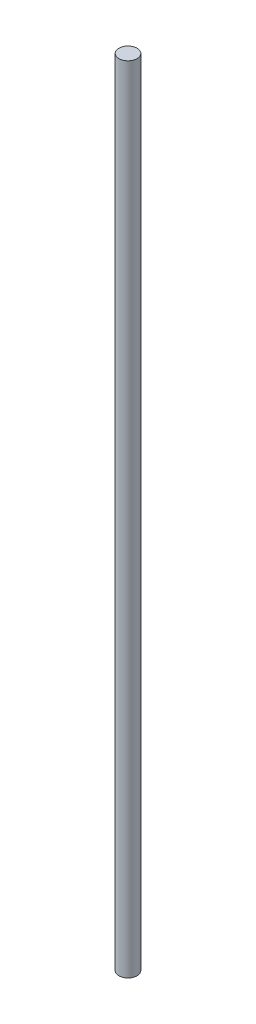
ISO-10303-21;
HEADER;
FILE_DESCRIPTION(('STEP AP214'),'2;1');
FILE_NAME('part.step','',(''),(''),'','','');
FILE_SCHEMA(('AUTOMOTIVE_DESIGN { 1 0 10303 214 1 1 1 1 }'));
ENDSEC;
DATA;
#1=APPLICATION_CONTEXT('core data for automotive mechanical design processes');
#2=APPLICATION_PROTOCOL_DEFINITION('international standard','automotive_design',2000,#1);
#3=PRODUCT_CONTEXT('',#1,'mechanical');
#4=PRODUCT('Part','Part','',(#3));
#5=PRODUCT_RELATED_PRODUCT_CATEGORY('part','',(#4));
#6=PRODUCT_DEFINITION_FORMATION('','',#4);
#7=PRODUCT_DEFINITION_CONTEXT('part definition',#1,'design');
#8=PRODUCT_DEFINITION('design','',#6,#7);
#9=PRODUCT_DEFINITION_SHAPE('','',#8);
#10=(LENGTH_UNIT() NAMED_UNIT(*) SI_UNIT(.MILLI.,.METRE.));
#11=(NAMED_UNIT(*) PLANE_ANGLE_UNIT() SI_UNIT($,.RADIAN.));
#12=(NAMED_UNIT(*) SI_UNIT($,.STERADIAN.) SOLID_ANGLE_UNIT());
#13=UNCERTAINTY_MEASURE_WITH_UNIT(LENGTH_MEASURE(1.E-05),#10,'distance_accuracy_value','');
#14=(GEOMETRIC_REPRESENTATION_CONTEXT(3) GLOBAL_UNCERTAINTY_ASSIGNED_CONTEXT((#13)) GLOBAL_UNIT_ASSIGNED_CONTEXT((#10,
#11,#12)) REPRESENTATION_CONTEXT('',''));
#15=CARTESIAN_POINT('',(0.,0.,0.));
#16=DIRECTION('',(0.,0.,1.));
#17=DIRECTION('',(1.,0.,0.));
#18=AXIS2_PLACEMENT_3D('',#15,#16,#17);
#19=CARTESIAN_POINT('',(0.,350.52,0.));
#20=DIRECTION('',(0.,-1.,0.));
#21=DIRECTION('',(0.,0.,-1.));
#22=AXIS2_PLACEMENT_3D('',#19,#20,#21);
#23=CYLINDRICAL_SURFACE('',#22,4.);
#24=CARTESIAN_POINT('',(0.,350.52,0.));
#25=DIRECTION('',(0.,1.,0.));
#26=DIRECTION('',(0.,0.,1.));
#27=AXIS2_PLACEMENT_3D('',#24,#25,#26);
#28=CIRCLE('',#27,4.);
#29=CARTESIAN_POINT('',(0.,350.52,4.));
#30=VERTEX_POINT('',#29);
#31=EDGE_CURVE('E10',#30,#30,#28,.T.);
#32=ORIENTED_EDGE('',*,*,#31,.F.);
#33=EDGE_LOOP('',(#32));
#34=FACE_BOUND('',#33,.T.);
#35=CARTESIAN_POINT('',(0.,0.,0.));
#36=DIRECTION('',(0.,1.,0.));
#37=DIRECTION('',(0.,0.,1.));
#38=AXIS2_PLACEMENT_3D('',#35,#36,#37);
#39=CIRCLE('',#38,4.);
#40=CARTESIAN_POINT('',(0.,0.,4.));
#41=VERTEX_POINT('',#40);
#42=EDGE_CURVE('E40',#41,#41,#39,.T.);
#43=ORIENTED_EDGE('',*,*,#42,.T.);
#44=EDGE_LOOP('',(#43));
#45=FACE_BOUND('',#44,.T.);
#46=ADVANCED_FACE('F37',(#34,#45),#23,.T.);
#47=CARTESIAN_POINT('',(0.,350.52,0.));
#48=DIRECTION('',(0.,1.,0.));
#49=DIRECTION('',(0.,0.,1.));
#50=AXIS2_PLACEMENT_3D('',#47,#48,#49);
#51=PLANE('',#50);
#52=ORIENTED_EDGE('',*,*,#31,.T.);
#53=EDGE_LOOP('',(#52));
#54=FACE_BOUND('',#53,.T.);
#55=ADVANCED_FACE('F54',(#54),#51,.T.);
#56=CARTESIAN_POINT('',(0.,0.,0.));
#57=DIRECTION('',(0.,1.,0.));
#58=DIRECTION('',(0.,0.,1.));
#59=AXIS2_PLACEMENT_3D('',#56,#57,#58);
#60=PLANE('',#59);
#61=ORIENTED_EDGE('',*,*,#42,.F.);
#62=EDGE_LOOP('',(#61));
#63=FACE_BOUND('',#62,.T.);
#64=ADVANCED_FACE('F52',(#63),#60,.F.);
#65=CLOSED_SHELL('',(#46,#55,#64));
#66=MANIFOLD_SOLID_BREP('B2',#65);
#67=ADVANCED_BREP_SHAPE_REPRESENTATION('',(#18,#66),#14);
#68=SHAPE_DEFINITION_REPRESENTATION(#9,#67);
ENDSEC;
END-ISO-10303-21;
